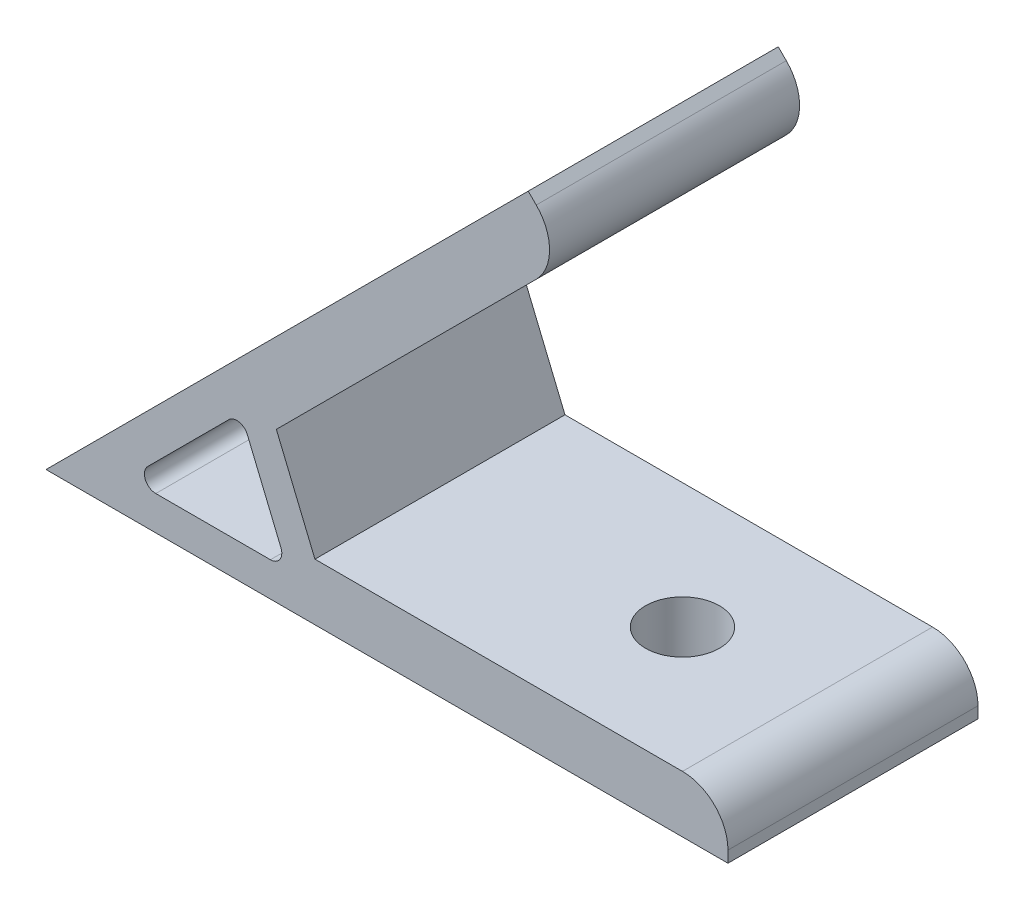
ISO-10303-21;
HEADER;
FILE_DESCRIPTION(('STEP AP214'),'2;1');
FILE_NAME('part.step','',(''),(''),'','','');
FILE_SCHEMA(('AUTOMOTIVE_DESIGN { 1 0 10303 214 1 1 1 1 }'));
ENDSEC;
DATA;
#1=APPLICATION_CONTEXT('core data for automotive mechanical design processes');
#2=APPLICATION_PROTOCOL_DEFINITION('international standard','automotive_design',2000,#1);
#3=PRODUCT_CONTEXT('',#1,'mechanical');
#4=PRODUCT('Part','Part','',(#3));
#5=PRODUCT_RELATED_PRODUCT_CATEGORY('part','',(#4));
#6=PRODUCT_DEFINITION_FORMATION('','',#4);
#7=PRODUCT_DEFINITION_CONTEXT('part definition',#1,'design');
#8=PRODUCT_DEFINITION('design','',#6,#7);
#9=PRODUCT_DEFINITION_SHAPE('','',#8);
#10=(LENGTH_UNIT() NAMED_UNIT(*) SI_UNIT(.MILLI.,.METRE.));
#11=(NAMED_UNIT(*) PLANE_ANGLE_UNIT() SI_UNIT($,.RADIAN.));
#12=(NAMED_UNIT(*) SI_UNIT($,.STERADIAN.) SOLID_ANGLE_UNIT());
#13=UNCERTAINTY_MEASURE_WITH_UNIT(LENGTH_MEASURE(1.E-05),#10,'distance_accuracy_value','');
#14=(GEOMETRIC_REPRESENTATION_CONTEXT(3) GLOBAL_UNCERTAINTY_ASSIGNED_CONTEXT((#13)) GLOBAL_UNIT_ASSIGNED_CONTEXT((#10,
#11,#12)) REPRESENTATION_CONTEXT('',''));
#15=CARTESIAN_POINT('',(0.,0.,0.));
#16=DIRECTION('',(0.,0.,1.));
#17=DIRECTION('',(1.,0.,0.));
#18=AXIS2_PLACEMENT_3D('',#15,#16,#17);
#19=CARTESIAN_POINT('',(0.,0.,11.));
#20=DIRECTION('',(0.,0.,1.));
#21=DIRECTION('',(1.,0.,0.));
#22=AXIS2_PLACEMENT_3D('',#19,#20,#21);
#23=PLANE('',#22);
#24=DIRECTION('',(0.,1.,0.));
#25=VECTOR('',#24,1.);
#26=CARTESIAN_POINT('',(60.,5.,11.));
#27=LINE('',#26,#25);
#28=CARTESIAN_POINT('',(60.,0.,11.));
#29=VERTEX_POINT('',#28);
#30=CARTESIAN_POINT('',(60.,1.,11.));
#31=VERTEX_POINT('',#30);
#32=EDGE_CURVE('E142',#29,#31,#27,.T.);
#33=ORIENTED_EDGE('',*,*,#32,.T.);
#34=CARTESIAN_POINT('',(56.,1.,11.));
#35=DIRECTION('',(0.,0.,1.));
#36=DIRECTION('',(1.,0.,0.));
#37=AXIS2_PLACEMENT_3D('',#34,#35,#36);
#38=CIRCLE('',#37,4.);
#39=CARTESIAN_POINT('',(56.,5.,11.));
#40=VERTEX_POINT('',#39);
#41=EDGE_CURVE('E184',#31,#40,#38,.T.);
#42=ORIENTED_EDGE('',*,*,#41,.T.);
#43=DIRECTION('',(-1.,0.,0.));
#44=VECTOR('',#43,1.);
#45=CARTESIAN_POINT('',(23.6613901632503,5.,11.));
#46=LINE('',#45,#44);
#47=CARTESIAN_POINT('',(23.6613901632503,5.,11.));
#48=VERTEX_POINT('',#47);
#49=EDGE_CURVE('E153',#40,#48,#46,.T.);
#50=ORIENTED_EDGE('',*,*,#49,.T.);
#51=DIRECTION('',(-0.382683432365087,0.923879532511288,0.));
#52=VECTOR('',#51,1.);
#53=CARTESIAN_POINT('',(20.2666633426678,13.1955955308021,11.));
#54=LINE('',#53,#52);
#55=CARTESIAN_POINT('',(20.2666633426678,13.1955955308021,11.));
#56=VERTEX_POINT('',#55);
#57=EDGE_CURVE('E244',#48,#56,#54,.T.);
#58=ORIENTED_EDGE('',*,*,#57,.T.);
#59=DIRECTION('',(0.707106781186551,0.707106781186544,0.));
#60=VECTOR('',#59,1.);
#61=CARTESIAN_POINT('',(45.9619407771258,38.8908729652599,11.));
#62=LINE('',#61,#60);
#63=CARTESIAN_POINT('',(43.1335136523796,36.0624458405137,11.));
#64=VERTEX_POINT('',#63);
#65=EDGE_CURVE('E246',#56,#64,#62,.T.);
#66=ORIENTED_EDGE('',*,*,#65,.T.);
#67=CARTESIAN_POINT('',(40.3050865276334,38.8908729652599,11.));
#68=DIRECTION('',(0.,0.,1.));
#69=DIRECTION('',(1.,0.,0.));
#70=AXIS2_PLACEMENT_3D('',#67,#68,#69);
#71=CIRCLE('',#70,4.);
#72=CARTESIAN_POINT('',(43.1335136523796,41.7193000900061,11.));
#73=VERTEX_POINT('',#72);
#74=EDGE_CURVE('E182',#64,#73,#71,.T.);
#75=ORIENTED_EDGE('',*,*,#74,.T.);
#76=DIRECTION('',(-0.707106781186543,0.707106781186552,0.));
#77=VECTOR('',#76,1.);
#78=CARTESIAN_POINT('',(42.4264068711931,42.4264068711926,11.));
#79=LINE('',#78,#77);
#80=CARTESIAN_POINT('',(42.4264068711931,42.4264068711926,11.));
#81=VERTEX_POINT('',#80);
#82=EDGE_CURVE('E249',#73,#81,#79,.T.);
#83=ORIENTED_EDGE('',*,*,#82,.T.);
#84=DIRECTION('',(-0.707106781186551,-0.707106781186544,0.));
#85=VECTOR('',#84,1.);
#86=CARTESIAN_POINT('',(0.,0.,11.));
#87=LINE('',#86,#85);
#88=CARTESIAN_POINT('',(0.,0.,11.));
#89=VERTEX_POINT('',#88);
#90=EDGE_CURVE('E158',#81,#89,#87,.T.);
#91=ORIENTED_EDGE('',*,*,#90,.T.);
#92=DIRECTION('',(1.,0.,0.));
#93=VECTOR('',#92,1.);
#94=CARTESIAN_POINT('',(60.,0.,11.));
#95=LINE('',#94,#93);
#96=EDGE_CURVE('E154',#89,#29,#95,.T.);
#97=ORIENTED_EDGE('',*,*,#96,.T.);
#98=EDGE_LOOP('',(#33,#42,#50,#58,#66,#75,#83,#91,#97));
#99=FACE_BOUND('',#98,.T.);
#100=DIRECTION('',(1.,0.,0.));
#101=VECTOR('',#100,1.);
#102=CARTESIAN_POINT('',(21.2426406871194,3.,11.));
#103=LINE('',#102,#101);
#104=CARTESIAN_POINT('',(9.65685424949248,3.,11.));
#105=VERTEX_POINT('',#104);
#106=CARTESIAN_POINT('',(19.7460349244539,3.,11.));
#107=VERTEX_POINT('',#106);
#108=EDGE_CURVE('E229',#105,#107,#103,.T.);
#109=ORIENTED_EDGE('',*,*,#108,.F.);
#110=CARTESIAN_POINT('',(9.65685424949247,4.,11.));
#111=DIRECTION('',(0.,0.,1.));
#112=DIRECTION('',(1.,0.,0.));
#113=AXIS2_PLACEMENT_3D('',#110,#111,#112);
#114=CIRCLE('',#113,1.);
#115=CARTESIAN_POINT('',(8.94974746830593,4.70710678118655,11.));
#116=VERTEX_POINT('',#115);
#117=EDGE_CURVE('E211',#105,#116,#114,.F.);
#118=ORIENTED_EDGE('',*,*,#117,.T.);
#119=DIRECTION('',(-0.707106781186551,-0.707106781186544,0.));
#120=VECTOR('',#119,1.);
#121=CARTESIAN_POINT('',(7.24264068711936,3.,11.));
#122=LINE('',#121,#120);
#123=CARTESIAN_POINT('',(16.0838755401874,11.841234853068,11.));
#124=VERTEX_POINT('',#123);
#125=EDGE_CURVE('E226',#124,#116,#122,.T.);
#126=ORIENTED_EDGE('',*,*,#125,.F.);
#127=CARTESIAN_POINT('',(16.790982321374,11.1341280718814,11.));
#128=DIRECTION('',(0.,0.,1.));
#129=DIRECTION('',(1.,0.,0.));
#130=AXIS2_PLACEMENT_3D('',#127,#128,#129);
#131=CIRCLE('',#130,1.);
#132=CARTESIAN_POINT('',(17.7148618538853,11.5168115042465,11.));
#133=VERTEX_POINT('',#132);
#134=EDGE_CURVE('E207',#124,#133,#131,.F.);
#135=ORIENTED_EDGE('',*,*,#134,.T.);
#136=DIRECTION('',(-0.382683432365087,0.923879532511288,0.));
#137=VECTOR('',#136,1.);
#138=CARTESIAN_POINT('',(17.1421356237311,12.8994949366116,11.));
#139=LINE('',#138,#137);
#140=CARTESIAN_POINT('',(20.6699144569652,4.38268343236509,11.));
#141=VERTEX_POINT('',#140);
#142=EDGE_CURVE('E231',#141,#133,#139,.T.);
#143=ORIENTED_EDGE('',*,*,#142,.F.);
#144=CARTESIAN_POINT('',(19.7460349244539,4.,11.));
#145=DIRECTION('',(0.,0.,1.));
#146=DIRECTION('',(1.,0.,0.));
#147=AXIS2_PLACEMENT_3D('',#144,#145,#146);
#148=CIRCLE('',#147,1.);
#149=EDGE_CURVE('E11',#141,#107,#148,.F.);
#150=ORIENTED_EDGE('',*,*,#149,.T.);
#151=EDGE_LOOP('',(#109,#118,#126,#135,#143,#150));
#152=FACE_BOUND('',#151,.T.);
#153=ADVANCED_FACE('F35',(#99,#152),#23,.T.);
#154=CARTESIAN_POINT('',(0.,0.,-11.));
#155=DIRECTION('',(0.,0.,1.));
#156=DIRECTION('',(1.,0.,0.));
#157=AXIS2_PLACEMENT_3D('',#154,#155,#156);
#158=PLANE('',#157);
#159=DIRECTION('',(-1.,0.,0.));
#160=VECTOR('',#159,1.);
#161=CARTESIAN_POINT('',(23.6613901632503,5.,-11.));
#162=LINE('',#161,#160);
#163=CARTESIAN_POINT('',(56.,5.,-11.));
#164=VERTEX_POINT('',#163);
#165=CARTESIAN_POINT('',(23.6613901632503,5.,-11.));
#166=VERTEX_POINT('',#165);
#167=EDGE_CURVE('E256',#164,#166,#162,.T.);
#168=ORIENTED_EDGE('',*,*,#167,.F.);
#169=CARTESIAN_POINT('',(56.,1.,-11.));
#170=DIRECTION('',(0.,0.,1.));
#171=DIRECTION('',(1.,0.,0.));
#172=AXIS2_PLACEMENT_3D('',#169,#170,#171);
#173=CIRCLE('',#172,4.);
#174=CARTESIAN_POINT('',(60.,1.,-11.));
#175=VERTEX_POINT('',#174);
#176=EDGE_CURVE('E179',#164,#175,#173,.F.);
#177=ORIENTED_EDGE('',*,*,#176,.T.);
#178=DIRECTION('',(0.,1.,0.));
#179=VECTOR('',#178,1.);
#180=CARTESIAN_POINT('',(60.,5.,-11.));
#181=LINE('',#180,#179);
#182=CARTESIAN_POINT('',(60.,0.,-11.));
#183=VERTEX_POINT('',#182);
#184=EDGE_CURVE('E254',#183,#175,#181,.T.);
#185=ORIENTED_EDGE('',*,*,#184,.F.);
#186=DIRECTION('',(1.,0.,0.));
#187=VECTOR('',#186,1.);
#188=CARTESIAN_POINT('',(60.,0.,-11.));
#189=LINE('',#188,#187);
#190=CARTESIAN_POINT('',(0.,0.,-11.));
#191=VERTEX_POINT('',#190);
#192=EDGE_CURVE('E166',#191,#183,#189,.T.);
#193=ORIENTED_EDGE('',*,*,#192,.F.);
#194=DIRECTION('',(-0.707106781186551,-0.707106781186544,0.));
#195=VECTOR('',#194,1.);
#196=CARTESIAN_POINT('',(0.,0.,-11.));
#197=LINE('',#196,#195);
#198=CARTESIAN_POINT('',(42.4264068711931,42.4264068711926,-11.));
#199=VERTEX_POINT('',#198);
#200=EDGE_CURVE('E162',#199,#191,#197,.T.);
#201=ORIENTED_EDGE('',*,*,#200,.F.);
#202=DIRECTION('',(-0.707106781186543,0.707106781186552,0.));
#203=VECTOR('',#202,1.);
#204=CARTESIAN_POINT('',(42.4264068711931,42.4264068711926,-11.));
#205=LINE('',#204,#203);
#206=CARTESIAN_POINT('',(43.1335136523796,41.7193000900061,-11.));
#207=VERTEX_POINT('',#206);
#208=EDGE_CURVE('E263',#207,#199,#205,.T.);
#209=ORIENTED_EDGE('',*,*,#208,.F.);
#210=CARTESIAN_POINT('',(40.3050865276334,38.8908729652599,-11.));
#211=DIRECTION('',(0.,0.,1.));
#212=DIRECTION('',(1.,0.,0.));
#213=AXIS2_PLACEMENT_3D('',#210,#211,#212);
#214=CIRCLE('',#213,4.);
#215=CARTESIAN_POINT('',(43.1335136523796,36.0624458405137,-11.));
#216=VERTEX_POINT('',#215);
#217=EDGE_CURVE('E171',#207,#216,#214,.F.);
#218=ORIENTED_EDGE('',*,*,#217,.T.);
#219=DIRECTION('',(0.707106781186551,0.707106781186544,0.));
#220=VECTOR('',#219,1.);
#221=CARTESIAN_POINT('',(45.9619407771258,38.8908729652599,-11.));
#222=LINE('',#221,#220);
#223=CARTESIAN_POINT('',(20.2666633426678,13.1955955308021,-11.));
#224=VERTEX_POINT('',#223);
#225=EDGE_CURVE('E260',#224,#216,#222,.T.);
#226=ORIENTED_EDGE('',*,*,#225,.F.);
#227=DIRECTION('',(-0.382683432365087,0.923879532511288,0.));
#228=VECTOR('',#227,1.);
#229=CARTESIAN_POINT('',(20.2666633426678,13.1955955308021,-11.));
#230=LINE('',#229,#228);
#231=EDGE_CURVE('E258',#166,#224,#230,.T.);
#232=ORIENTED_EDGE('',*,*,#231,.F.);
#233=EDGE_LOOP('',(#168,#177,#185,#193,#201,#209,#218,#226,#232));
#234=FACE_BOUND('',#233,.T.);
#235=DIRECTION('',(-0.382683432365087,0.923879532511288,0.));
#236=VECTOR('',#235,1.);
#237=CARTESIAN_POINT('',(17.1421356237311,12.8994949366116,-11.));
#238=LINE('',#237,#236);
#239=CARTESIAN_POINT('',(20.6699144569652,4.38268343236509,-11.));
#240=VERTEX_POINT('',#239);
#241=CARTESIAN_POINT('',(17.7148618538853,11.5168115042465,-11.));
#242=VERTEX_POINT('',#241);
#243=EDGE_CURVE('E217',#240,#242,#238,.T.);
#244=ORIENTED_EDGE('',*,*,#243,.T.);
#245=CARTESIAN_POINT('',(16.790982321374,11.1341280718814,-11.));
#246=DIRECTION('',(0.,0.,1.));
#247=DIRECTION('',(1.,0.,0.));
#248=AXIS2_PLACEMENT_3D('',#245,#246,#247);
#249=CIRCLE('',#248,1.);
#250=CARTESIAN_POINT('',(16.0838755401874,11.841234853068,-11.));
#251=VERTEX_POINT('',#250);
#252=EDGE_CURVE('E205',#242,#251,#249,.T.);
#253=ORIENTED_EDGE('',*,*,#252,.T.);
#254=DIRECTION('',(-0.707106781186551,-0.707106781186544,0.));
#255=VECTOR('',#254,1.);
#256=CARTESIAN_POINT('',(7.24264068711936,3.,-11.));
#257=LINE('',#256,#255);
#258=CARTESIAN_POINT('',(8.94974746830593,4.70710678118655,-11.));
#259=VERTEX_POINT('',#258);
#260=EDGE_CURVE('E238',#251,#259,#257,.T.);
#261=ORIENTED_EDGE('',*,*,#260,.T.);
#262=CARTESIAN_POINT('',(9.65685424949247,4.,-11.));
#263=DIRECTION('',(0.,0.,1.));
#264=DIRECTION('',(1.,0.,0.));
#265=AXIS2_PLACEMENT_3D('',#262,#263,#264);
#266=CIRCLE('',#265,1.);
#267=CARTESIAN_POINT('',(9.65685424949248,3.,-11.));
#268=VERTEX_POINT('',#267);
#269=EDGE_CURVE('E209',#259,#268,#266,.T.);
#270=ORIENTED_EDGE('',*,*,#269,.T.);
#271=DIRECTION('',(1.,0.,0.));
#272=VECTOR('',#271,1.);
#273=CARTESIAN_POINT('',(21.2426406871194,3.,-11.));
#274=LINE('',#273,#272);
#275=CARTESIAN_POINT('',(19.7460349244539,3.,-11.));
#276=VERTEX_POINT('',#275);
#277=EDGE_CURVE('E218',#268,#276,#274,.T.);
#278=ORIENTED_EDGE('',*,*,#277,.T.);
#279=CARTESIAN_POINT('',(19.7460349244539,4.,-11.));
#280=DIRECTION('',(0.,0.,1.));
#281=DIRECTION('',(1.,0.,0.));
#282=AXIS2_PLACEMENT_3D('',#279,#280,#281);
#283=CIRCLE('',#282,1.);
#284=EDGE_CURVE('E43',#276,#240,#283,.T.);
#285=ORIENTED_EDGE('',*,*,#284,.T.);
#286=EDGE_LOOP('',(#244,#253,#261,#270,#278,#285));
#287=FACE_BOUND('',#286,.T.);
#288=ADVANCED_FACE('F216',(#234,#287),#158,.F.);
#289=CARTESIAN_POINT('',(60.,0.,11.));
#290=DIRECTION('',(0.,1.,0.));
#291=DIRECTION('',(0.,0.,1.));
#292=AXIS2_PLACEMENT_3D('',#289,#290,#291);
#293=PLANE('',#292);
#294=CARTESIAN_POINT('',(45.,0.,0.));
#295=DIRECTION('',(0.,-1.,0.));
#296=DIRECTION('',(0.,0.,-1.));
#297=AXIS2_PLACEMENT_3D('',#294,#295,#296);
#298=CIRCLE('',#297,3.25);
#299=CARTESIAN_POINT('',(45.,0.,-3.25));
#300=VERTEX_POINT('',#299);
#301=EDGE_CURVE('E343',#300,#300,#298,.T.);
#302=ORIENTED_EDGE('',*,*,#301,.F.);
#303=EDGE_LOOP('',(#302));
#304=FACE_BOUND('',#303,.T.);
#305=ORIENTED_EDGE('',*,*,#192,.T.);
#306=DIRECTION('',(0.,0.,-1.));
#307=VECTOR('',#306,1.);
#308=CARTESIAN_POINT('',(60.,0.,11.));
#309=LINE('',#308,#307);
#310=EDGE_CURVE('E147',#29,#183,#309,.T.);
#311=ORIENTED_EDGE('',*,*,#310,.F.);
#312=ORIENTED_EDGE('',*,*,#96,.F.);
#313=DIRECTION('',(0.,0.,-1.));
#314=VECTOR('',#313,1.);
#315=CARTESIAN_POINT('',(0.,0.,11.));
#316=LINE('',#315,#314);
#317=EDGE_CURVE('E252',#89,#191,#316,.T.);
#318=ORIENTED_EDGE('',*,*,#317,.T.);
#319=EDGE_LOOP('',(#305,#311,#312,#318));
#320=FACE_BOUND('',#319,.T.);
#321=ADVANCED_FACE('F164',(#304,#320),#293,.F.);
#322=CARTESIAN_POINT('',(60.,5.,11.));
#323=DIRECTION('',(-1.,0.,0.));
#324=DIRECTION('',(0.,0.,1.));
#325=AXIS2_PLACEMENT_3D('',#322,#323,#324);
#326=PLANE('',#325);
#327=ORIENTED_EDGE('',*,*,#184,.T.);
#328=DIRECTION('',(0.,0.,-1.));
#329=VECTOR('',#328,1.);
#330=CARTESIAN_POINT('',(60.,1.,11.));
#331=LINE('',#330,#329);
#332=EDGE_CURVE('E150',#175,#31,#331,.F.);
#333=ORIENTED_EDGE('',*,*,#332,.T.);
#334=ORIENTED_EDGE('',*,*,#32,.F.);
#335=ORIENTED_EDGE('',*,*,#310,.T.);
#336=EDGE_LOOP('',(#327,#333,#334,#335));
#337=FACE_BOUND('',#336,.T.);
#338=ADVANCED_FACE('F145',(#337),#326,.F.);
#339=CARTESIAN_POINT('',(23.6613901632503,5.,11.));
#340=DIRECTION('',(0.,-1.,0.));
#341=DIRECTION('',(0.,0.,-1.));
#342=AXIS2_PLACEMENT_3D('',#339,#340,#341);
#343=PLANE('',#342);
#344=CARTESIAN_POINT('',(45.,5.,0.));
#345=DIRECTION('',(0.,-1.,0.));
#346=DIRECTION('',(0.,0.,-1.));
#347=AXIS2_PLACEMENT_3D('',#344,#345,#346);
#348=CIRCLE('',#347,3.25);
#349=CARTESIAN_POINT('',(45.,5.,-3.25));
#350=VERTEX_POINT('',#349);
#351=EDGE_CURVE('E345',#350,#350,#348,.F.);
#352=ORIENTED_EDGE('',*,*,#351,.F.);
#353=EDGE_LOOP('',(#352));
#354=FACE_BOUND('',#353,.T.);
#355=ORIENTED_EDGE('',*,*,#49,.F.);
#356=DIRECTION('',(0.,0.,-1.));
#357=VECTOR('',#356,1.);
#358=CARTESIAN_POINT('',(56.,5.,11.));
#359=LINE('',#358,#357);
#360=EDGE_CURVE('E167',#40,#164,#359,.T.);
#361=ORIENTED_EDGE('',*,*,#360,.T.);
#362=ORIENTED_EDGE('',*,*,#167,.T.);
#363=DIRECTION('',(0.,0.,-1.));
#364=VECTOR('',#363,1.);
#365=CARTESIAN_POINT('',(23.6613901632503,5.,11.));
#366=LINE('',#365,#364);
#367=EDGE_CURVE('E168',#48,#166,#366,.T.);
#368=ORIENTED_EDGE('',*,*,#367,.F.);
#369=EDGE_LOOP('',(#355,#361,#362,#368));
#370=FACE_BOUND('',#369,.T.);
#371=ADVANCED_FACE('F295',(#354,#370),#343,.F.);
#372=CARTESIAN_POINT('',(20.2666633426678,13.1955955308021,11.));
#373=DIRECTION('',(-0.923879532511288,-0.382683432365087,0.));
#374=DIRECTION('',(0.382683432365087,-0.923879532511288,0.));
#375=AXIS2_PLACEMENT_3D('',#372,#373,#374);
#376=PLANE('',#375);
#377=ORIENTED_EDGE('',*,*,#231,.T.);
#378=DIRECTION('',(0.,0.,-1.));
#379=VECTOR('',#378,1.);
#380=CARTESIAN_POINT('',(20.2666633426678,13.1955955308021,11.));
#381=LINE('',#380,#379);
#382=EDGE_CURVE('E174',#56,#224,#381,.T.);
#383=ORIENTED_EDGE('',*,*,#382,.F.);
#384=ORIENTED_EDGE('',*,*,#57,.F.);
#385=ORIENTED_EDGE('',*,*,#367,.T.);
#386=EDGE_LOOP('',(#377,#383,#384,#385));
#387=FACE_BOUND('',#386,.T.);
#388=ADVANCED_FACE('F293',(#387),#376,.F.);
#389=CARTESIAN_POINT('',(45.9619407771258,38.8908729652599,11.));
#390=DIRECTION('',(-0.707106781186544,0.707106781186551,0.));
#391=DIRECTION('',(-0.707106781186551,-0.707106781186544,0.));
#392=AXIS2_PLACEMENT_3D('',#389,#390,#391);
#393=PLANE('',#392);
#394=CARTESIAN_POINT('',(35.3553390593275,28.2842712474617,0.));
#395=DIRECTION('',(-0.707106781186544,0.707106781186551,0.));
#396=DIRECTION('',(-0.707106781186551,-0.707106781186544,0.));
#397=AXIS2_PLACEMENT_3D('',#394,#395,#396);
#398=CIRCLE('',#397,3.25);
#399=CARTESIAN_POINT('',(33.0572420204712,25.9861742086054,0.));
#400=VERTEX_POINT('',#399);
#401=EDGE_CURVE('E241',#400,#400,#398,.F.);
#402=ORIENTED_EDGE('',*,*,#401,.F.);
#403=EDGE_LOOP('',(#402));
#404=FACE_BOUND('',#403,.T.);
#405=ORIENTED_EDGE('',*,*,#225,.T.);
#406=DIRECTION('',(0.,0.,-1.));
#407=VECTOR('',#406,1.);
#408=CARTESIAN_POINT('',(43.1335136523796,36.0624458405137,11.));
#409=LINE('',#408,#407);
#410=EDGE_CURVE('E189',#216,#64,#409,.F.);
#411=ORIENTED_EDGE('',*,*,#410,.T.);
#412=ORIENTED_EDGE('',*,*,#65,.F.);
#413=ORIENTED_EDGE('',*,*,#382,.T.);
#414=EDGE_LOOP('',(#405,#411,#412,#413));
#415=FACE_BOUND('',#414,.T.);
#416=ADVANCED_FACE('F274',(#404,#415),#393,.F.);
#417=CARTESIAN_POINT('',(42.4264068711931,42.4264068711926,11.));
#418=DIRECTION('',(-0.707106781186552,-0.707106781186543,0.));
#419=DIRECTION('',(0.707106781186543,-0.707106781186552,0.));
#420=AXIS2_PLACEMENT_3D('',#417,#418,#419);
#421=PLANE('',#420);
#422=ORIENTED_EDGE('',*,*,#82,.F.);
#423=DIRECTION('',(0.,0.,-1.));
#424=VECTOR('',#423,1.);
#425=CARTESIAN_POINT('',(43.1335136523796,41.7193000900061,11.));
#426=LINE('',#425,#424);
#427=EDGE_CURVE('E186',#73,#207,#426,.T.);
#428=ORIENTED_EDGE('',*,*,#427,.T.);
#429=ORIENTED_EDGE('',*,*,#208,.T.);
#430=DIRECTION('',(0.,0.,-1.));
#431=VECTOR('',#430,1.);
#432=CARTESIAN_POINT('',(42.4264068711931,42.4264068711926,11.));
#433=LINE('',#432,#431);
#434=EDGE_CURVE('E267',#81,#199,#433,.T.);
#435=ORIENTED_EDGE('',*,*,#434,.F.);
#436=EDGE_LOOP('',(#422,#428,#429,#435));
#437=FACE_BOUND('',#436,.T.);
#438=ADVANCED_FACE('F289',(#437),#421,.F.);
#439=CARTESIAN_POINT('',(0.,0.,11.));
#440=DIRECTION('',(0.707106781186544,-0.707106781186551,0.));
#441=DIRECTION('',(0.707106781186551,0.707106781186544,0.));
#442=AXIS2_PLACEMENT_3D('',#439,#440,#441);
#443=PLANE('',#442);
#444=CARTESIAN_POINT('',(31.8198051533948,31.8198051533945,0.));
#445=DIRECTION('',(-0.707106781186544,0.707106781186551,0.));
#446=DIRECTION('',(-0.707106781186551,-0.707106781186544,0.));
#447=AXIS2_PLACEMENT_3D('',#444,#445,#446);
#448=CIRCLE('',#447,3.25);
#449=CARTESIAN_POINT('',(29.5217081145385,29.5217081145382,0.));
#450=VERTEX_POINT('',#449);
#451=EDGE_CURVE('E348',#450,#450,#448,.T.);
#452=ORIENTED_EDGE('',*,*,#451,.F.);
#453=EDGE_LOOP('',(#452));
#454=FACE_BOUND('',#453,.T.);
#455=ORIENTED_EDGE('',*,*,#200,.T.);
#456=ORIENTED_EDGE('',*,*,#317,.F.);
#457=ORIENTED_EDGE('',*,*,#90,.F.);
#458=ORIENTED_EDGE('',*,*,#434,.T.);
#459=EDGE_LOOP('',(#455,#456,#457,#458));
#460=FACE_BOUND('',#459,.T.);
#461=ADVANCED_FACE('F322',(#454,#460),#443,.F.);
#462=CARTESIAN_POINT('',(7.24264068711936,3.,11.));
#463=DIRECTION('',(0.707106781186544,-0.707106781186551,0.));
#464=DIRECTION('',(0.707106781186551,0.707106781186544,0.));
#465=AXIS2_PLACEMENT_3D('',#462,#463,#464);
#466=PLANE('',#465);
#467=ORIENTED_EDGE('',*,*,#260,.F.);
#468=DIRECTION('',(0.,0.,-1.));
#469=VECTOR('',#468,1.);
#470=CARTESIAN_POINT('',(16.0838755401874,11.841234853068,11.));
#471=LINE('',#470,#469);
#472=EDGE_CURVE('E199',#251,#124,#471,.F.);
#473=ORIENTED_EDGE('',*,*,#472,.T.);
#474=ORIENTED_EDGE('',*,*,#125,.T.);
#475=DIRECTION('',(0.,0.,-1.));
#476=VECTOR('',#475,1.);
#477=CARTESIAN_POINT('',(8.94974746830593,4.70710678118655,-11.));
#478=LINE('',#477,#476);
#479=EDGE_CURVE('E196',#116,#259,#478,.T.);
#480=ORIENTED_EDGE('',*,*,#479,.T.);
#481=EDGE_LOOP('',(#467,#473,#474,#480));
#482=FACE_BOUND('',#481,.T.);
#483=ADVANCED_FACE('F319',(#482),#466,.T.);
#484=CARTESIAN_POINT('',(21.2426406871194,3.,11.));
#485=DIRECTION('',(0.,1.,0.));
#486=DIRECTION('',(0.,0.,1.));
#487=AXIS2_PLACEMENT_3D('',#484,#485,#486);
#488=PLANE('',#487);
#489=ORIENTED_EDGE('',*,*,#277,.F.);
#490=DIRECTION('',(0.,0.,-1.));
#491=VECTOR('',#490,1.);
#492=CARTESIAN_POINT('',(9.65685424949247,3.,11.));
#493=LINE('',#492,#491);
#494=EDGE_CURVE('E55',#268,#105,#493,.F.);
#495=ORIENTED_EDGE('',*,*,#494,.T.);
#496=ORIENTED_EDGE('',*,*,#108,.T.);
#497=DIRECTION('',(0.,0.,-1.));
#498=VECTOR('',#497,1.);
#499=CARTESIAN_POINT('',(19.7460349244539,3.,-11.));
#500=LINE('',#499,#498);
#501=EDGE_CURVE('E201',#107,#276,#500,.T.);
#502=ORIENTED_EDGE('',*,*,#501,.T.);
#503=EDGE_LOOP('',(#489,#495,#496,#502));
#504=FACE_BOUND('',#503,.T.);
#505=ADVANCED_FACE('F228',(#504),#488,.T.);
#506=CARTESIAN_POINT('',(17.1421356237311,12.8994949366116,11.));
#507=DIRECTION('',(-0.923879532511288,-0.382683432365087,0.));
#508=DIRECTION('',(0.382683432365087,-0.923879532511288,0.));
#509=AXIS2_PLACEMENT_3D('',#506,#507,#508);
#510=PLANE('',#509);
#511=ORIENTED_EDGE('',*,*,#142,.T.);
#512=DIRECTION('',(0.,0.,-1.));
#513=VECTOR('',#512,1.);
#514=CARTESIAN_POINT('',(17.7148618538853,11.5168115042465,-11.));
#515=LINE('',#514,#513);
#516=EDGE_CURVE('E193',#133,#242,#515,.T.);
#517=ORIENTED_EDGE('',*,*,#516,.T.);
#518=ORIENTED_EDGE('',*,*,#243,.F.);
#519=DIRECTION('',(0.,0.,-1.));
#520=VECTOR('',#519,1.);
#521=CARTESIAN_POINT('',(20.6699144569652,4.38268343236509,11.));
#522=LINE('',#521,#520);
#523=EDGE_CURVE('E191',#240,#141,#522,.F.);
#524=ORIENTED_EDGE('',*,*,#523,.T.);
#525=EDGE_LOOP('',(#511,#517,#518,#524));
#526=FACE_BOUND('',#525,.T.);
#527=ADVANCED_FACE('F224',(#526),#510,.T.);
#528=CARTESIAN_POINT('',(41.8553390593275,21.7842712474617,0.));
#529=DIRECTION('',(-0.707106781186544,0.707106781186551,0.));
#530=DIRECTION('',(-0.707106781186551,-0.707106781186544,0.));
#531=AXIS2_PLACEMENT_3D('',#528,#529,#530);
#532=CYLINDRICAL_SURFACE('',#531,3.25);
#533=ORIENTED_EDGE('',*,*,#401,.T.);
#534=EDGE_LOOP('',(#533));
#535=FACE_BOUND('',#534,.T.);
#536=ORIENTED_EDGE('',*,*,#451,.T.);
#537=EDGE_LOOP('',(#536));
#538=FACE_BOUND('',#537,.T.);
#539=ADVANCED_FACE('F308',(#535,#538),#532,.F.);
#540=CARTESIAN_POINT('',(45.,14.1923881554251,0.));
#541=DIRECTION('',(0.,-1.,0.));
#542=DIRECTION('',(0.,0.,-1.));
#543=AXIS2_PLACEMENT_3D('',#540,#541,#542);
#544=CYLINDRICAL_SURFACE('',#543,3.25);
#545=ORIENTED_EDGE('',*,*,#351,.T.);
#546=EDGE_LOOP('',(#545));
#547=FACE_BOUND('',#546,.T.);
#548=ORIENTED_EDGE('',*,*,#301,.T.);
#549=EDGE_LOOP('',(#548));
#550=FACE_BOUND('',#549,.T.);
#551=ADVANCED_FACE('F300',(#547,#550),#544,.F.);
#552=CARTESIAN_POINT('',(56.,1.,11.));
#553=DIRECTION('',(0.,0.,-1.));
#554=DIRECTION('',(-1.,0.,0.));
#555=AXIS2_PLACEMENT_3D('',#552,#553,#554);
#556=CYLINDRICAL_SURFACE('',#555,4.);
#557=ORIENTED_EDGE('',*,*,#41,.F.);
#558=ORIENTED_EDGE('',*,*,#332,.F.);
#559=ORIENTED_EDGE('',*,*,#176,.F.);
#560=ORIENTED_EDGE('',*,*,#360,.F.);
#561=EDGE_LOOP('',(#557,#558,#559,#560));
#562=FACE_BOUND('',#561,.T.);
#563=ADVANCED_FACE('F298',(#562),#556,.T.);
#564=CARTESIAN_POINT('',(40.3050865276334,38.8908729652599,11.));
#565=DIRECTION('',(0.,0.,-1.));
#566=DIRECTION('',(-1.,0.,0.));
#567=AXIS2_PLACEMENT_3D('',#564,#565,#566);
#568=CYLINDRICAL_SURFACE('',#567,4.);
#569=ORIENTED_EDGE('',*,*,#74,.F.);
#570=ORIENTED_EDGE('',*,*,#410,.F.);
#571=ORIENTED_EDGE('',*,*,#217,.F.);
#572=ORIENTED_EDGE('',*,*,#427,.F.);
#573=EDGE_LOOP('',(#569,#570,#571,#572));
#574=FACE_BOUND('',#573,.T.);
#575=ADVANCED_FACE('F286',(#574),#568,.T.);
#576=CARTESIAN_POINT('',(16.790982321374,11.1341280718814,11.));
#577=DIRECTION('',(0.,0.,1.));
#578=DIRECTION('',(1.,0.,0.));
#579=AXIS2_PLACEMENT_3D('',#576,#577,#578);
#580=CYLINDRICAL_SURFACE('',#579,1.);
#581=ORIENTED_EDGE('',*,*,#134,.F.);
#582=ORIENTED_EDGE('',*,*,#472,.F.);
#583=ORIENTED_EDGE('',*,*,#252,.F.);
#584=ORIENTED_EDGE('',*,*,#516,.F.);
#585=EDGE_LOOP('',(#581,#582,#583,#584));
#586=FACE_BOUND('',#585,.T.);
#587=ADVANCED_FACE('F306',(#586),#580,.F.);
#588=CARTESIAN_POINT('',(9.65685424949247,4.,11.));
#589=DIRECTION('',(0.,0.,1.));
#590=DIRECTION('',(1.,0.,0.));
#591=AXIS2_PLACEMENT_3D('',#588,#589,#590);
#592=CYLINDRICAL_SURFACE('',#591,1.);
#593=ORIENTED_EDGE('',*,*,#117,.F.);
#594=ORIENTED_EDGE('',*,*,#494,.F.);
#595=ORIENTED_EDGE('',*,*,#269,.F.);
#596=ORIENTED_EDGE('',*,*,#479,.F.);
#597=EDGE_LOOP('',(#593,#594,#595,#596));
#598=FACE_BOUND('',#597,.T.);
#599=ADVANCED_FACE('F378',(#598),#592,.F.);
#600=CARTESIAN_POINT('',(19.7460349244539,4.,11.));
#601=DIRECTION('',(0.,0.,1.));
#602=DIRECTION('',(1.,0.,0.));
#603=AXIS2_PLACEMENT_3D('',#600,#601,#602);
#604=CYLINDRICAL_SURFACE('',#603,1.);
#605=ORIENTED_EDGE('',*,*,#149,.F.);
#606=ORIENTED_EDGE('',*,*,#523,.F.);
#607=ORIENTED_EDGE('',*,*,#284,.F.);
#608=ORIENTED_EDGE('',*,*,#501,.F.);
#609=EDGE_LOOP('',(#605,#606,#607,#608));
#610=FACE_BOUND('',#609,.T.);
#611=ADVANCED_FACE('F37',(#610),#604,.F.);
#612=CLOSED_SHELL('',(#153,#288,#321,#338,#371,#388,#416,#438,#461,#483,#505,#527,#539,#551,
#563,#575,#587,#599,#611));
#613=MANIFOLD_SOLID_BREP('B2',#612);
#614=ADVANCED_BREP_SHAPE_REPRESENTATION('',(#18,#613),#14);
#615=SHAPE_DEFINITION_REPRESENTATION(#9,#614);
ENDSEC;
END-ISO-10303-21;
